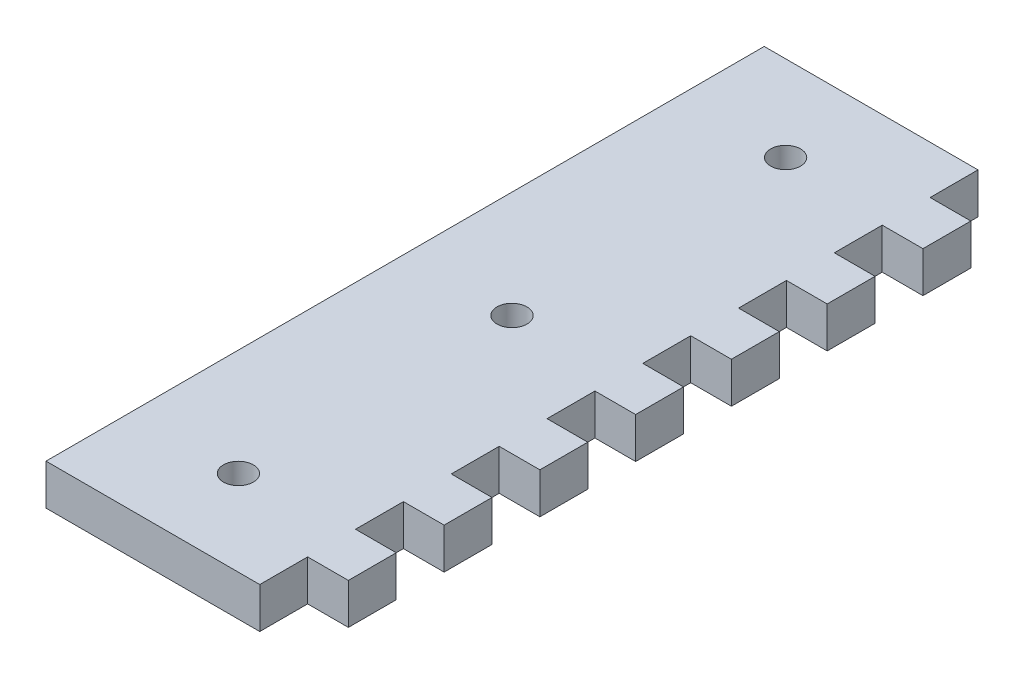
ISO-10303-21;
HEADER;
FILE_DESCRIPTION(('STEP AP214'),'2;1');
FILE_NAME('part.step','',(''),(''),'','','');
FILE_SCHEMA(('AUTOMOTIVE_DESIGN { 1 0 10303 214 1 1 1 1 }'));
ENDSEC;
DATA;
#1=APPLICATION_CONTEXT('core data for automotive mechanical design processes');
#2=APPLICATION_PROTOCOL_DEFINITION('international standard','automotive_design',2000,#1);
#3=PRODUCT_CONTEXT('',#1,'mechanical');
#4=PRODUCT('Part','Part','',(#3));
#5=PRODUCT_RELATED_PRODUCT_CATEGORY('part','',(#4));
#6=PRODUCT_DEFINITION_FORMATION('','',#4);
#7=PRODUCT_DEFINITION_CONTEXT('part definition',#1,'design');
#8=PRODUCT_DEFINITION('design','',#6,#7);
#9=PRODUCT_DEFINITION_SHAPE('','',#8);
#10=(LENGTH_UNIT() NAMED_UNIT(*) SI_UNIT(.MILLI.,.METRE.));
#11=(NAMED_UNIT(*) PLANE_ANGLE_UNIT() SI_UNIT($,.RADIAN.));
#12=(NAMED_UNIT(*) SI_UNIT($,.STERADIAN.) SOLID_ANGLE_UNIT());
#13=UNCERTAINTY_MEASURE_WITH_UNIT(LENGTH_MEASURE(1.E-05),#10,'distance_accuracy_value','');
#14=(GEOMETRIC_REPRESENTATION_CONTEXT(3) GLOBAL_UNCERTAINTY_ASSIGNED_CONTEXT((#13)) GLOBAL_UNIT_ASSIGNED_CONTEXT((#10,
#11,#12)) REPRESENTATION_CONTEXT('',''));
#15=CARTESIAN_POINT('',(0.,0.,0.));
#16=DIRECTION('',(0.,0.,1.));
#17=DIRECTION('',(1.,0.,0.));
#18=AXIS2_PLACEMENT_3D('',#15,#16,#17);
#19=CARTESIAN_POINT('',(0.,4.7625,0.));
#20=DIRECTION('',(0.,0.,-1.));
#21=DIRECTION('',(-1.,0.,0.));
#22=AXIS2_PLACEMENT_3D('',#19,#20,#21);
#23=PLANE('',#22);
#24=DIRECTION('',(1.,0.,0.));
#25=VECTOR('',#24,1.);
#26=CARTESIAN_POINT('',(0.,0.,0.));
#27=LINE('',#26,#25);
#28=CARTESIAN_POINT('',(0.,0.,0.));
#29=VERTEX_POINT('',#28);
#30=CARTESIAN_POINT('',(25.,0.,0.));
#31=VERTEX_POINT('',#30);
#32=EDGE_CURVE('E302',#29,#31,#27,.T.);
#33=ORIENTED_EDGE('',*,*,#32,.T.);
#34=DIRECTION('',(0.,-1.,0.));
#35=VECTOR('',#34,1.);
#36=CARTESIAN_POINT('',(25.,4.7625,0.));
#37=LINE('',#36,#35);
#38=CARTESIAN_POINT('',(25.,4.7625,0.));
#39=VERTEX_POINT('',#38);
#40=EDGE_CURVE('E11',#39,#31,#37,.T.);
#41=ORIENTED_EDGE('',*,*,#40,.F.);
#42=DIRECTION('',(1.,0.,0.));
#43=VECTOR('',#42,1.);
#44=CARTESIAN_POINT('',(0.,4.7625,0.));
#45=LINE('',#44,#43);
#46=CARTESIAN_POINT('',(0.,4.7625,0.));
#47=VERTEX_POINT('',#46);
#48=EDGE_CURVE('E1057',#47,#39,#45,.T.);
#49=ORIENTED_EDGE('',*,*,#48,.F.);
#50=DIRECTION('',(0.,-1.,0.));
#51=VECTOR('',#50,1.);
#52=CARTESIAN_POINT('',(0.,4.7625,0.));
#53=LINE('',#52,#51);
#54=EDGE_CURVE('E59',#47,#29,#53,.T.);
#55=ORIENTED_EDGE('',*,*,#54,.T.);
#56=EDGE_LOOP('',(#33,#41,#49,#55));
#57=FACE_BOUND('',#56,.T.);
#58=ADVANCED_FACE('F41',(#57),#23,.F.);
#59=CARTESIAN_POINT('',(25.,4.7625,0.));
#60=DIRECTION('',(-1.,0.,0.));
#61=DIRECTION('',(0.,0.,1.));
#62=AXIS2_PLACEMENT_3D('',#59,#60,#61);
#63=PLANE('',#62);
#64=DIRECTION('',(0.,0.,-1.));
#65=VECTOR('',#64,1.);
#66=CARTESIAN_POINT('',(25.,0.,0.));
#67=LINE('',#66,#65);
#68=CARTESIAN_POINT('',(25.,0.,-5.60000000000009));
#69=VERTEX_POINT('',#68);
#70=EDGE_CURVE('E305',#31,#69,#67,.T.);
#71=ORIENTED_EDGE('',*,*,#70,.T.);
#72=DIRECTION('',(0.,-1.,0.));
#73=VECTOR('',#72,1.);
#74=CARTESIAN_POINT('',(25.,4.7625,-5.60000000000009));
#75=LINE('',#74,#73);
#76=CARTESIAN_POINT('',(25.,4.7625,-5.60000000000009));
#77=VERTEX_POINT('',#76);
#78=EDGE_CURVE('E51',#77,#69,#75,.T.);
#79=ORIENTED_EDGE('',*,*,#78,.F.);
#80=DIRECTION('',(0.,0.,-1.));
#81=VECTOR('',#80,1.);
#82=CARTESIAN_POINT('',(25.,4.7625,0.));
#83=LINE('',#82,#81);
#84=EDGE_CURVE('E169',#39,#77,#83,.T.);
#85=ORIENTED_EDGE('',*,*,#84,.F.);
#86=ORIENTED_EDGE('',*,*,#40,.T.);
#87=EDGE_LOOP('',(#71,#79,#85,#86));
#88=FACE_BOUND('',#87,.T.);
#89=ADVANCED_FACE('F704',(#88),#63,.F.);
#90=CARTESIAN_POINT('',(0.,4.7625,-5.59999999999999));
#91=DIRECTION('',(0.,0.,-1.));
#92=DIRECTION('',(-1.,0.,0.));
#93=AXIS2_PLACEMENT_3D('',#90,#91,#92);
#94=PLANE('',#93);
#95=DIRECTION('',(1.,0.,0.));
#96=VECTOR('',#95,1.);
#97=CARTESIAN_POINT('',(0.,0.,-5.59999999999999));
#98=LINE('',#97,#96);
#99=CARTESIAN_POINT('',(29.7624999999998,0.,-5.6000000000001));
#100=VERTEX_POINT('',#99);
#101=EDGE_CURVE('E308',#69,#100,#98,.T.);
#102=ORIENTED_EDGE('',*,*,#101,.T.);
#103=DIRECTION('',(0.,-1.,0.));
#104=VECTOR('',#103,1.);
#105=CARTESIAN_POINT('',(29.7624999999998,4.7625,-5.6000000000001));
#106=LINE('',#105,#104);
#107=CARTESIAN_POINT('',(29.7624999999998,4.7625,-5.6000000000001));
#108=VERTEX_POINT('',#107);
#109=EDGE_CURVE('E491',#108,#100,#106,.T.);
#110=ORIENTED_EDGE('',*,*,#109,.F.);
#111=DIRECTION('',(1.,0.,0.));
#112=VECTOR('',#111,1.);
#113=CARTESIAN_POINT('',(0.,4.7625,-5.59999999999999));
#114=LINE('',#113,#112);
#115=EDGE_CURVE('E501',#77,#108,#114,.T.);
#116=ORIENTED_EDGE('',*,*,#115,.F.);
#117=ORIENTED_EDGE('',*,*,#78,.T.);
#118=EDGE_LOOP('',(#102,#110,#116,#117));
#119=FACE_BOUND('',#118,.T.);
#120=ADVANCED_FACE('F499',(#119),#94,.F.);
#121=CARTESIAN_POINT('',(29.7624999999999,4.7625,-1.10635087400913E-13));
#122=DIRECTION('',(-1.,0.,0.));
#123=DIRECTION('',(0.,0.,1.));
#124=AXIS2_PLACEMENT_3D('',#121,#122,#123);
#125=PLANE('',#124);
#126=DIRECTION('',(0.,0.,-1.));
#127=VECTOR('',#126,1.);
#128=CARTESIAN_POINT('',(29.7624999999999,0.,-1.10635087400913E-13));
#129=LINE('',#128,#127);
#130=CARTESIAN_POINT('',(29.7624999999998,0.,-11.2000000000001));
#131=VERTEX_POINT('',#130);
#132=EDGE_CURVE('E312',#100,#131,#129,.T.);
#133=ORIENTED_EDGE('',*,*,#132,.T.);
#134=DIRECTION('',(0.,-1.,0.));
#135=VECTOR('',#134,1.);
#136=CARTESIAN_POINT('',(29.7624999999998,4.7625,-11.2000000000001));
#137=LINE('',#136,#135);
#138=CARTESIAN_POINT('',(29.7624999999998,4.7625,-11.2000000000001));
#139=VERTEX_POINT('',#138);
#140=EDGE_CURVE('E487',#139,#131,#137,.T.);
#141=ORIENTED_EDGE('',*,*,#140,.F.);
#142=DIRECTION('',(0.,0.,-1.));
#143=VECTOR('',#142,1.);
#144=CARTESIAN_POINT('',(29.7624999999999,4.7625,-1.10635087400913E-13));
#145=LINE('',#144,#143);
#146=EDGE_CURVE('E519',#108,#139,#145,.T.);
#147=ORIENTED_EDGE('',*,*,#146,.F.);
#148=ORIENTED_EDGE('',*,*,#109,.T.);
#149=EDGE_LOOP('',(#133,#141,#147,#148));
#150=FACE_BOUND('',#149,.T.);
#151=ADVANCED_FACE('F509',(#150),#125,.F.);
#152=CARTESIAN_POINT('',(0.,4.7625,-11.2));
#153=DIRECTION('',(0.,0.,1.));
#154=DIRECTION('',(1.,0.,0.));
#155=AXIS2_PLACEMENT_3D('',#152,#153,#154);
#156=PLANE('',#155);
#157=DIRECTION('',(-1.,0.,0.));
#158=VECTOR('',#157,1.);
#159=CARTESIAN_POINT('',(0.,0.,-11.2));
#160=LINE('',#159,#158);
#161=CARTESIAN_POINT('',(25.,0.,-11.2000000000001));
#162=VERTEX_POINT('',#161);
#163=EDGE_CURVE('E315',#131,#162,#160,.T.);
#164=ORIENTED_EDGE('',*,*,#163,.T.);
#165=DIRECTION('',(0.,-1.,0.));
#166=VECTOR('',#165,1.);
#167=CARTESIAN_POINT('',(25.,4.7625,-11.2000000000001));
#168=LINE('',#167,#166);
#169=CARTESIAN_POINT('',(25.,4.7625,-11.2000000000001));
#170=VERTEX_POINT('',#169);
#171=EDGE_CURVE('E483',#170,#162,#168,.T.);
#172=ORIENTED_EDGE('',*,*,#171,.F.);
#173=DIRECTION('',(-1.,0.,0.));
#174=VECTOR('',#173,1.);
#175=CARTESIAN_POINT('',(0.,4.7625,-11.2));
#176=LINE('',#175,#174);
#177=EDGE_CURVE('E515',#139,#170,#176,.T.);
#178=ORIENTED_EDGE('',*,*,#177,.F.);
#179=ORIENTED_EDGE('',*,*,#140,.T.);
#180=EDGE_LOOP('',(#164,#172,#178,#179));
#181=FACE_BOUND('',#180,.T.);
#182=ADVANCED_FACE('F513',(#181),#156,.F.);
#183=CARTESIAN_POINT('',(24.9999999999999,0.,-16.8000000000001));
#184=VERTEX_POINT('',#183);
#185=EDGE_CURVE('E309',#162,#184,#67,.T.);
#186=ORIENTED_EDGE('',*,*,#185,.T.);
#187=DIRECTION('',(0.,-1.,0.));
#188=VECTOR('',#187,1.);
#189=CARTESIAN_POINT('',(24.9999999999999,4.7625,-16.8000000000001));
#190=LINE('',#189,#188);
#191=CARTESIAN_POINT('',(24.9999999999999,4.7625,-16.8000000000001));
#192=VERTEX_POINT('',#191);
#193=EDGE_CURVE('E479',#192,#184,#190,.T.);
#194=ORIENTED_EDGE('',*,*,#193,.F.);
#195=EDGE_CURVE('E518',#170,#192,#83,.T.);
#196=ORIENTED_EDGE('',*,*,#195,.F.);
#197=ORIENTED_EDGE('',*,*,#171,.T.);
#198=EDGE_LOOP('',(#186,#194,#196,#197));
#199=FACE_BOUND('',#198,.T.);
#200=ADVANCED_FACE('F614',(#199),#63,.F.);
#201=CARTESIAN_POINT('',(0.,4.7625,-16.8));
#202=DIRECTION('',(0.,0.,-1.));
#203=DIRECTION('',(-1.,0.,0.));
#204=AXIS2_PLACEMENT_3D('',#201,#202,#203);
#205=PLANE('',#204);
#206=DIRECTION('',(1.,0.,0.));
#207=VECTOR('',#206,1.);
#208=CARTESIAN_POINT('',(0.,0.,-16.8));
#209=LINE('',#208,#207);
#210=CARTESIAN_POINT('',(29.7624999999998,0.,-16.8000000000001));
#211=VERTEX_POINT('',#210);
#212=EDGE_CURVE('E318',#184,#211,#209,.T.);
#213=ORIENTED_EDGE('',*,*,#212,.T.);
#214=DIRECTION('',(0.,-1.,0.));
#215=VECTOR('',#214,1.);
#216=CARTESIAN_POINT('',(29.7624999999998,4.7625,-16.8000000000001));
#217=LINE('',#216,#215);
#218=CARTESIAN_POINT('',(29.7624999999998,4.7625,-16.8000000000001));
#219=VERTEX_POINT('',#218);
#220=EDGE_CURVE('E475',#219,#211,#217,.T.);
#221=ORIENTED_EDGE('',*,*,#220,.F.);
#222=DIRECTION('',(1.,0.,0.));
#223=VECTOR('',#222,1.);
#224=CARTESIAN_POINT('',(0.,4.7625,-16.8));
#225=LINE('',#224,#223);
#226=EDGE_CURVE('E523',#192,#219,#225,.T.);
#227=ORIENTED_EDGE('',*,*,#226,.F.);
#228=ORIENTED_EDGE('',*,*,#193,.T.);
#229=EDGE_LOOP('',(#213,#221,#227,#228));
#230=FACE_BOUND('',#229,.T.);
#231=ADVANCED_FACE('F618',(#230),#205,.F.);
#232=CARTESIAN_POINT('',(29.7624999999999,4.7625,-1.10635087400913E-13));
#233=DIRECTION('',(-1.,0.,0.));
#234=DIRECTION('',(0.,0.,1.));
#235=AXIS2_PLACEMENT_3D('',#232,#233,#234);
#236=PLANE('',#235);
#237=DIRECTION('',(0.,0.,-1.));
#238=VECTOR('',#237,1.);
#239=CARTESIAN_POINT('',(29.7624999999999,0.,-1.10635087400913E-13));
#240=LINE('',#239,#238);
#241=CARTESIAN_POINT('',(29.7624999999998,0.,-22.4000000000001));
#242=VERTEX_POINT('',#241);
#243=EDGE_CURVE('E321',#211,#242,#240,.T.);
#244=ORIENTED_EDGE('',*,*,#243,.T.);
#245=DIRECTION('',(0.,-1.,0.));
#246=VECTOR('',#245,1.);
#247=CARTESIAN_POINT('',(29.7624999999998,4.7625,-22.4000000000001));
#248=LINE('',#247,#246);
#249=CARTESIAN_POINT('',(29.7624999999998,4.7625,-22.4000000000001));
#250=VERTEX_POINT('',#249);
#251=EDGE_CURVE('E471',#250,#242,#248,.T.);
#252=ORIENTED_EDGE('',*,*,#251,.F.);
#253=DIRECTION('',(0.,0.,-1.));
#254=VECTOR('',#253,1.);
#255=CARTESIAN_POINT('',(29.7624999999999,4.7625,-1.10635087400913E-13));
#256=LINE('',#255,#254);
#257=EDGE_CURVE('E530',#219,#250,#256,.T.);
#258=ORIENTED_EDGE('',*,*,#257,.F.);
#259=ORIENTED_EDGE('',*,*,#220,.T.);
#260=EDGE_LOOP('',(#244,#252,#258,#259));
#261=FACE_BOUND('',#260,.T.);
#262=ADVANCED_FACE('F624',(#261),#236,.F.);
#263=CARTESIAN_POINT('',(0.,4.7625,-22.4));
#264=DIRECTION('',(0.,0.,1.));
#265=DIRECTION('',(1.,0.,0.));
#266=AXIS2_PLACEMENT_3D('',#263,#264,#265);
#267=PLANE('',#266);
#268=DIRECTION('',(-1.,0.,0.));
#269=VECTOR('',#268,1.);
#270=CARTESIAN_POINT('',(0.,0.,-22.4));
#271=LINE('',#270,#269);
#272=CARTESIAN_POINT('',(24.9999999999999,0.,-22.4000000000001));
#273=VERTEX_POINT('',#272);
#274=EDGE_CURVE('E324',#242,#273,#271,.T.);
#275=ORIENTED_EDGE('',*,*,#274,.T.);
#276=DIRECTION('',(0.,-1.,0.));
#277=VECTOR('',#276,1.);
#278=CARTESIAN_POINT('',(24.9999999999999,4.7625,-22.4000000000001));
#279=LINE('',#278,#277);
#280=CARTESIAN_POINT('',(24.9999999999999,4.7625,-22.4000000000001));
#281=VERTEX_POINT('',#280);
#282=EDGE_CURVE('E467',#281,#273,#279,.T.);
#283=ORIENTED_EDGE('',*,*,#282,.F.);
#284=DIRECTION('',(-1.,0.,0.));
#285=VECTOR('',#284,1.);
#286=CARTESIAN_POINT('',(0.,4.7625,-22.4));
#287=LINE('',#286,#285);
#288=EDGE_CURVE('E533',#250,#281,#287,.T.);
#289=ORIENTED_EDGE('',*,*,#288,.F.);
#290=ORIENTED_EDGE('',*,*,#251,.T.);
#291=EDGE_LOOP('',(#275,#283,#289,#290));
#292=FACE_BOUND('',#291,.T.);
#293=ADVANCED_FACE('F628',(#292),#267,.F.);
#294=CARTESIAN_POINT('',(24.9999999999999,0.,-28.0000000000001));
#295=VERTEX_POINT('',#294);
#296=EDGE_CURVE('E327',#273,#295,#67,.T.);
#297=ORIENTED_EDGE('',*,*,#296,.T.);
#298=DIRECTION('',(0.,-1.,0.));
#299=VECTOR('',#298,1.);
#300=CARTESIAN_POINT('',(24.9999999999999,4.7625,-28.0000000000001));
#301=LINE('',#300,#299);
#302=CARTESIAN_POINT('',(24.9999999999999,4.7625,-28.0000000000001));
#303=VERTEX_POINT('',#302);
#304=EDGE_CURVE('E463',#303,#295,#301,.T.);
#305=ORIENTED_EDGE('',*,*,#304,.F.);
#306=EDGE_CURVE('E524',#281,#303,#83,.T.);
#307=ORIENTED_EDGE('',*,*,#306,.F.);
#308=ORIENTED_EDGE('',*,*,#282,.T.);
#309=EDGE_LOOP('',(#297,#305,#307,#308));
#310=FACE_BOUND('',#309,.T.);
#311=ADVANCED_FACE('F634',(#310),#63,.F.);
#312=CARTESIAN_POINT('',(0.,4.7625,-28.));
#313=DIRECTION('',(0.,0.,-1.));
#314=DIRECTION('',(-1.,0.,0.));
#315=AXIS2_PLACEMENT_3D('',#312,#313,#314);
#316=PLANE('',#315);
#317=DIRECTION('',(1.,0.,0.));
#318=VECTOR('',#317,1.);
#319=CARTESIAN_POINT('',(0.,0.,-28.));
#320=LINE('',#319,#318);
#321=CARTESIAN_POINT('',(29.7624999999998,0.,-28.0000000000001));
#322=VERTEX_POINT('',#321);
#323=EDGE_CURVE('E328',#295,#322,#320,.T.);
#324=ORIENTED_EDGE('',*,*,#323,.T.);
#325=DIRECTION('',(0.,-1.,0.));
#326=VECTOR('',#325,1.);
#327=CARTESIAN_POINT('',(29.7624999999998,4.7625,-28.0000000000001));
#328=LINE('',#327,#326);
#329=CARTESIAN_POINT('',(29.7624999999998,4.7625,-28.0000000000001));
#330=VERTEX_POINT('',#329);
#331=EDGE_CURVE('E459',#330,#322,#328,.T.);
#332=ORIENTED_EDGE('',*,*,#331,.F.);
#333=DIRECTION('',(1.,0.,0.));
#334=VECTOR('',#333,1.);
#335=CARTESIAN_POINT('',(0.,4.7625,-28.));
#336=LINE('',#335,#334);
#337=EDGE_CURVE('E536',#303,#330,#336,.T.);
#338=ORIENTED_EDGE('',*,*,#337,.F.);
#339=ORIENTED_EDGE('',*,*,#304,.T.);
#340=EDGE_LOOP('',(#324,#332,#338,#339));
#341=FACE_BOUND('',#340,.T.);
#342=ADVANCED_FACE('F637',(#341),#316,.F.);
#343=CARTESIAN_POINT('',(29.7624999999999,4.7625,-1.10635087400913E-13));
#344=DIRECTION('',(-1.,0.,0.));
#345=DIRECTION('',(0.,0.,1.));
#346=AXIS2_PLACEMENT_3D('',#343,#344,#345);
#347=PLANE('',#346);
#348=DIRECTION('',(0.,0.,-1.));
#349=VECTOR('',#348,1.);
#350=CARTESIAN_POINT('',(29.7624999999999,0.,-1.10635087400913E-13));
#351=LINE('',#350,#349);
#352=CARTESIAN_POINT('',(29.7624999999997,0.,-33.6000000000001));
#353=VERTEX_POINT('',#352);
#354=EDGE_CURVE('E331',#322,#353,#351,.T.);
#355=ORIENTED_EDGE('',*,*,#354,.T.);
#356=DIRECTION('',(0.,-1.,0.));
#357=VECTOR('',#356,1.);
#358=CARTESIAN_POINT('',(29.7624999999997,4.7625,-33.6000000000001));
#359=LINE('',#358,#357);
#360=CARTESIAN_POINT('',(29.7624999999997,4.7625,-33.6000000000001));
#361=VERTEX_POINT('',#360);
#362=EDGE_CURVE('E455',#361,#353,#359,.T.);
#363=ORIENTED_EDGE('',*,*,#362,.F.);
#364=DIRECTION('',(0.,0.,-1.));
#365=VECTOR('',#364,1.);
#366=CARTESIAN_POINT('',(29.7624999999999,4.7625,-1.10635087400913E-13));
#367=LINE('',#366,#365);
#368=EDGE_CURVE('E539',#330,#361,#367,.T.);
#369=ORIENTED_EDGE('',*,*,#368,.F.);
#370=ORIENTED_EDGE('',*,*,#331,.T.);
#371=EDGE_LOOP('',(#355,#363,#369,#370));
#372=FACE_BOUND('',#371,.T.);
#373=ADVANCED_FACE('F642',(#372),#347,.F.);
#374=CARTESIAN_POINT('',(0.,4.7625,-33.6));
#375=DIRECTION('',(0.,0.,1.));
#376=DIRECTION('',(1.,0.,0.));
#377=AXIS2_PLACEMENT_3D('',#374,#375,#376);
#378=PLANE('',#377);
#379=DIRECTION('',(-1.,0.,0.));
#380=VECTOR('',#379,1.);
#381=CARTESIAN_POINT('',(0.,0.,-33.6));
#382=LINE('',#381,#380);
#383=CARTESIAN_POINT('',(24.9999999999999,0.,-33.6000000000001));
#384=VERTEX_POINT('',#383);
#385=EDGE_CURVE('E334',#353,#384,#382,.T.);
#386=ORIENTED_EDGE('',*,*,#385,.T.);
#387=DIRECTION('',(0.,-1.,0.));
#388=VECTOR('',#387,1.);
#389=CARTESIAN_POINT('',(24.9999999999999,4.7625,-33.6000000000001));
#390=LINE('',#389,#388);
#391=CARTESIAN_POINT('',(24.9999999999999,4.7625,-33.6000000000001));
#392=VERTEX_POINT('',#391);
#393=EDGE_CURVE('E451',#392,#384,#390,.T.);
#394=ORIENTED_EDGE('',*,*,#393,.F.);
#395=DIRECTION('',(-1.,0.,0.));
#396=VECTOR('',#395,1.);
#397=CARTESIAN_POINT('',(0.,4.7625,-33.6));
#398=LINE('',#397,#396);
#399=EDGE_CURVE('E542',#361,#392,#398,.T.);
#400=ORIENTED_EDGE('',*,*,#399,.F.);
#401=ORIENTED_EDGE('',*,*,#362,.T.);
#402=EDGE_LOOP('',(#386,#394,#400,#401));
#403=FACE_BOUND('',#402,.T.);
#404=ADVANCED_FACE('F647',(#403),#378,.F.);
#405=CARTESIAN_POINT('',(24.9999999999999,0.,-39.2000000000001));
#406=VERTEX_POINT('',#405);
#407=EDGE_CURVE('E337',#384,#406,#67,.T.);
#408=ORIENTED_EDGE('',*,*,#407,.T.);
#409=DIRECTION('',(0.,-1.,0.));
#410=VECTOR('',#409,1.);
#411=CARTESIAN_POINT('',(24.9999999999999,4.7625,-39.2000000000001));
#412=LINE('',#411,#410);
#413=CARTESIAN_POINT('',(24.9999999999999,4.7625,-39.2000000000001));
#414=VERTEX_POINT('',#413);
#415=EDGE_CURVE('E447',#414,#406,#412,.T.);
#416=ORIENTED_EDGE('',*,*,#415,.F.);
#417=EDGE_CURVE('E545',#392,#414,#83,.T.);
#418=ORIENTED_EDGE('',*,*,#417,.F.);
#419=ORIENTED_EDGE('',*,*,#393,.T.);
#420=EDGE_LOOP('',(#408,#416,#418,#419));
#421=FACE_BOUND('',#420,.T.);
#422=ADVANCED_FACE('F649',(#421),#63,.F.);
#423=CARTESIAN_POINT('',(-1.71341506162623E-13,4.7625,-39.2));
#424=DIRECTION('',(0.,0.,-1.));
#425=DIRECTION('',(-1.,0.,0.));
#426=AXIS2_PLACEMENT_3D('',#423,#424,#425);
#427=PLANE('',#426);
#428=DIRECTION('',(1.,0.,0.));
#429=VECTOR('',#428,1.);
#430=CARTESIAN_POINT('',(-1.71341506162623E-13,0.,-39.2));
#431=LINE('',#430,#429);
#432=CARTESIAN_POINT('',(29.7624999999997,0.,-39.2000000000001));
#433=VERTEX_POINT('',#432);
#434=EDGE_CURVE('E338',#406,#433,#431,.T.);
#435=ORIENTED_EDGE('',*,*,#434,.T.);
#436=DIRECTION('',(0.,-1.,0.));
#437=VECTOR('',#436,1.);
#438=CARTESIAN_POINT('',(29.7624999999997,4.7625,-39.2000000000001));
#439=LINE('',#438,#437);
#440=CARTESIAN_POINT('',(29.7624999999997,4.7625,-39.2000000000001));
#441=VERTEX_POINT('',#440);
#442=EDGE_CURVE('E443',#441,#433,#439,.T.);
#443=ORIENTED_EDGE('',*,*,#442,.F.);
#444=DIRECTION('',(1.,0.,0.));
#445=VECTOR('',#444,1.);
#446=CARTESIAN_POINT('',(-1.71341506162623E-13,4.7625,-39.2));
#447=LINE('',#446,#445);
#448=EDGE_CURVE('E546',#414,#441,#447,.T.);
#449=ORIENTED_EDGE('',*,*,#448,.F.);
#450=ORIENTED_EDGE('',*,*,#415,.T.);
#451=EDGE_LOOP('',(#435,#443,#449,#450));
#452=FACE_BOUND('',#451,.T.);
#453=ADVANCED_FACE('F772',(#452),#427,.F.);
#454=CARTESIAN_POINT('',(29.7624999999999,4.7625,-1.10635087400913E-13));
#455=DIRECTION('',(-1.,0.,0.));
#456=DIRECTION('',(0.,0.,1.));
#457=AXIS2_PLACEMENT_3D('',#454,#455,#456);
#458=PLANE('',#457);
#459=DIRECTION('',(0.,0.,-1.));
#460=VECTOR('',#459,1.);
#461=CARTESIAN_POINT('',(29.7624999999999,0.,-1.10635087400913E-13));
#462=LINE('',#461,#460);
#463=CARTESIAN_POINT('',(29.7624999999997,0.,-44.8000000000001));
#464=VERTEX_POINT('',#463);
#465=EDGE_CURVE('E341',#433,#464,#462,.T.);
#466=ORIENTED_EDGE('',*,*,#465,.T.);
#467=DIRECTION('',(0.,-1.,0.));
#468=VECTOR('',#467,1.);
#469=CARTESIAN_POINT('',(29.7624999999997,4.7625,-44.8000000000001));
#470=LINE('',#469,#468);
#471=CARTESIAN_POINT('',(29.7624999999997,4.7625,-44.8000000000001));
#472=VERTEX_POINT('',#471);
#473=EDGE_CURVE('E439',#472,#464,#470,.T.);
#474=ORIENTED_EDGE('',*,*,#473,.F.);
#475=DIRECTION('',(0.,0.,-1.));
#476=VECTOR('',#475,1.);
#477=CARTESIAN_POINT('',(29.7624999999999,4.7625,-1.10635087400913E-13));
#478=LINE('',#477,#476);
#479=EDGE_CURVE('E549',#441,#472,#478,.T.);
#480=ORIENTED_EDGE('',*,*,#479,.F.);
#481=ORIENTED_EDGE('',*,*,#442,.T.);
#482=EDGE_LOOP('',(#466,#474,#480,#481));
#483=FACE_BOUND('',#482,.T.);
#484=ADVANCED_FACE('F768',(#483),#458,.F.);
#485=CARTESIAN_POINT('',(-1.95818864185854E-13,4.7625,-44.8));
#486=DIRECTION('',(0.,0.,1.));
#487=DIRECTION('',(1.,0.,0.));
#488=AXIS2_PLACEMENT_3D('',#485,#486,#487);
#489=PLANE('',#488);
#490=DIRECTION('',(-1.,0.,0.));
#491=VECTOR('',#490,1.);
#492=CARTESIAN_POINT('',(-1.95818864185854E-13,0.,-44.8));
#493=LINE('',#492,#491);
#494=CARTESIAN_POINT('',(24.9999999999998,0.,-44.8000000000001));
#495=VERTEX_POINT('',#494);
#496=EDGE_CURVE('E344',#464,#495,#493,.T.);
#497=ORIENTED_EDGE('',*,*,#496,.T.);
#498=DIRECTION('',(0.,-1.,0.));
#499=VECTOR('',#498,1.);
#500=CARTESIAN_POINT('',(24.9999999999998,4.7625,-44.8000000000001));
#501=LINE('',#500,#499);
#502=CARTESIAN_POINT('',(24.9999999999998,4.7625,-44.8000000000001));
#503=VERTEX_POINT('',#502);
#504=EDGE_CURVE('E435',#503,#495,#501,.T.);
#505=ORIENTED_EDGE('',*,*,#504,.F.);
#506=DIRECTION('',(-1.,0.,0.));
#507=VECTOR('',#506,1.);
#508=CARTESIAN_POINT('',(-1.95818864185854E-13,4.7625,-44.8));
#509=LINE('',#508,#507);
#510=EDGE_CURVE('E552',#472,#503,#509,.T.);
#511=ORIENTED_EDGE('',*,*,#510,.F.);
#512=ORIENTED_EDGE('',*,*,#473,.T.);
#513=EDGE_LOOP('',(#497,#505,#511,#512));
#514=FACE_BOUND('',#513,.T.);
#515=ADVANCED_FACE('F702',(#514),#489,.F.);
#516=CARTESIAN_POINT('',(24.9999999999998,0.,-50.4000000000001));
#517=VERTEX_POINT('',#516);
#518=EDGE_CURVE('E347',#495,#517,#67,.T.);
#519=ORIENTED_EDGE('',*,*,#518,.T.);
#520=DIRECTION('',(0.,-1.,0.));
#521=VECTOR('',#520,1.);
#522=CARTESIAN_POINT('',(24.9999999999998,4.7625,-50.4000000000001));
#523=LINE('',#522,#521);
#524=CARTESIAN_POINT('',(24.9999999999998,4.7625,-50.4000000000001));
#525=VERTEX_POINT('',#524);
#526=EDGE_CURVE('E431',#525,#517,#523,.T.);
#527=ORIENTED_EDGE('',*,*,#526,.F.);
#528=EDGE_CURVE('E555',#503,#525,#83,.T.);
#529=ORIENTED_EDGE('',*,*,#528,.F.);
#530=ORIENTED_EDGE('',*,*,#504,.T.);
#531=EDGE_LOOP('',(#519,#527,#529,#530));
#532=FACE_BOUND('',#531,.T.);
#533=ADVANCED_FACE('F689',(#532),#63,.F.);
#534=CARTESIAN_POINT('',(-2.20296222209086E-13,4.7625,-50.4));
#535=DIRECTION('',(0.,0.,-1.));
#536=DIRECTION('',(-1.,0.,0.));
#537=AXIS2_PLACEMENT_3D('',#534,#535,#536);
#538=PLANE('',#537);
#539=DIRECTION('',(1.,0.,0.));
#540=VECTOR('',#539,1.);
#541=CARTESIAN_POINT('',(-2.20296222209086E-13,0.,-50.4));
#542=LINE('',#541,#540);
#543=CARTESIAN_POINT('',(29.7624999999997,0.,-50.4000000000001));
#544=VERTEX_POINT('',#543);
#545=EDGE_CURVE('E348',#517,#544,#542,.T.);
#546=ORIENTED_EDGE('',*,*,#545,.T.);
#547=DIRECTION('',(0.,-1.,0.));
#548=VECTOR('',#547,1.);
#549=CARTESIAN_POINT('',(29.7624999999997,4.7625,-50.4000000000001));
#550=LINE('',#549,#548);
#551=CARTESIAN_POINT('',(29.7624999999997,4.7625,-50.4000000000001));
#552=VERTEX_POINT('',#551);
#553=EDGE_CURVE('E427',#552,#544,#550,.T.);
#554=ORIENTED_EDGE('',*,*,#553,.F.);
#555=DIRECTION('',(1.,0.,0.));
#556=VECTOR('',#555,1.);
#557=CARTESIAN_POINT('',(-2.20296222209086E-13,4.7625,-50.4));
#558=LINE('',#557,#556);
#559=EDGE_CURVE('E556',#525,#552,#558,.T.);
#560=ORIENTED_EDGE('',*,*,#559,.F.);
#561=ORIENTED_EDGE('',*,*,#526,.T.);
#562=EDGE_LOOP('',(#546,#554,#560,#561));
#563=FACE_BOUND('',#562,.T.);
#564=ADVANCED_FACE('F701',(#563),#538,.F.);
#565=CARTESIAN_POINT('',(29.7624999999999,4.7625,-1.10635087400913E-13));
#566=DIRECTION('',(-1.,0.,0.));
#567=DIRECTION('',(0.,0.,1.));
#568=AXIS2_PLACEMENT_3D('',#565,#566,#567);
#569=PLANE('',#568);
#570=DIRECTION('',(0.,0.,-1.));
#571=VECTOR('',#570,1.);
#572=CARTESIAN_POINT('',(29.7624999999999,0.,-1.10635087400913E-13));
#573=LINE('',#572,#571);
#574=CARTESIAN_POINT('',(29.7624999999997,0.,-56.0000000000001));
#575=VERTEX_POINT('',#574);
#576=EDGE_CURVE('E351',#544,#575,#573,.T.);
#577=ORIENTED_EDGE('',*,*,#576,.T.);
#578=DIRECTION('',(0.,-1.,0.));
#579=VECTOR('',#578,1.);
#580=CARTESIAN_POINT('',(29.7624999999997,4.7625,-56.0000000000001));
#581=LINE('',#580,#579);
#582=CARTESIAN_POINT('',(29.7624999999997,4.7625,-56.0000000000001));
#583=VERTEX_POINT('',#582);
#584=EDGE_CURVE('E423',#583,#575,#581,.T.);
#585=ORIENTED_EDGE('',*,*,#584,.F.);
#586=DIRECTION('',(0.,0.,-1.));
#587=VECTOR('',#586,1.);
#588=CARTESIAN_POINT('',(29.7624999999999,4.7625,-1.10635087400913E-13));
#589=LINE('',#588,#587);
#590=EDGE_CURVE('E559',#552,#583,#589,.T.);
#591=ORIENTED_EDGE('',*,*,#590,.F.);
#592=ORIENTED_EDGE('',*,*,#553,.T.);
#593=EDGE_LOOP('',(#577,#585,#591,#592));
#594=FACE_BOUND('',#593,.T.);
#595=ADVANCED_FACE('F695',(#594),#569,.F.);
#596=CARTESIAN_POINT('',(-2.44773580232318E-13,4.7625,-56.));
#597=DIRECTION('',(0.,0.,1.));
#598=DIRECTION('',(1.,0.,0.));
#599=AXIS2_PLACEMENT_3D('',#596,#597,#598);
#600=PLANE('',#599);
#601=DIRECTION('',(-1.,0.,0.));
#602=VECTOR('',#601,1.);
#603=CARTESIAN_POINT('',(-2.44773580232318E-13,0.,-56.));
#604=LINE('',#603,#602);
#605=CARTESIAN_POINT('',(24.9999999999998,0.,-56.0000000000001));
#606=VERTEX_POINT('',#605);
#607=EDGE_CURVE('E354',#575,#606,#604,.T.);
#608=ORIENTED_EDGE('',*,*,#607,.T.);
#609=DIRECTION('',(0.,-1.,0.));
#610=VECTOR('',#609,1.);
#611=CARTESIAN_POINT('',(24.9999999999998,4.7625,-56.0000000000001));
#612=LINE('',#611,#610);
#613=CARTESIAN_POINT('',(24.9999999999998,4.7625,-56.0000000000001));
#614=VERTEX_POINT('',#613);
#615=EDGE_CURVE('E419',#614,#606,#612,.T.);
#616=ORIENTED_EDGE('',*,*,#615,.F.);
#617=DIRECTION('',(-1.,0.,0.));
#618=VECTOR('',#617,1.);
#619=CARTESIAN_POINT('',(-2.44773580232318E-13,4.7625,-56.));
#620=LINE('',#619,#618);
#621=EDGE_CURVE('E562',#583,#614,#620,.T.);
#622=ORIENTED_EDGE('',*,*,#621,.F.);
#623=ORIENTED_EDGE('',*,*,#584,.T.);
#624=EDGE_LOOP('',(#608,#616,#622,#623));
#625=FACE_BOUND('',#624,.T.);
#626=ADVANCED_FACE('F683',(#625),#600,.F.);
#627=CARTESIAN_POINT('',(24.9999999999998,0.,-61.6000000000001));
#628=VERTEX_POINT('',#627);
#629=EDGE_CURVE('E357',#606,#628,#67,.T.);
#630=ORIENTED_EDGE('',*,*,#629,.T.);
#631=DIRECTION('',(0.,-1.,0.));
#632=VECTOR('',#631,1.);
#633=CARTESIAN_POINT('',(24.9999999999998,4.7625,-61.6000000000001));
#634=LINE('',#633,#632);
#635=CARTESIAN_POINT('',(24.9999999999998,4.7625,-61.6000000000001));
#636=VERTEX_POINT('',#635);
#637=EDGE_CURVE('E415',#636,#628,#634,.T.);
#638=ORIENTED_EDGE('',*,*,#637,.F.);
#639=EDGE_CURVE('E565',#614,#636,#83,.T.);
#640=ORIENTED_EDGE('',*,*,#639,.F.);
#641=ORIENTED_EDGE('',*,*,#615,.T.);
#642=EDGE_LOOP('',(#630,#638,#640,#641));
#643=FACE_BOUND('',#642,.T.);
#644=ADVANCED_FACE('F686',(#643),#63,.F.);
#645=CARTESIAN_POINT('',(-2.6925093825555E-13,4.7625,-61.6));
#646=DIRECTION('',(0.,0.,-1.));
#647=DIRECTION('',(-1.,0.,0.));
#648=AXIS2_PLACEMENT_3D('',#645,#646,#647);
#649=PLANE('',#648);
#650=DIRECTION('',(1.,0.,0.));
#651=VECTOR('',#650,1.);
#652=CARTESIAN_POINT('',(-2.6925093825555E-13,0.,-61.6));
#653=LINE('',#652,#651);
#654=CARTESIAN_POINT('',(29.7624999999996,0.,-61.6000000000001));
#655=VERTEX_POINT('',#654);
#656=EDGE_CURVE('E358',#628,#655,#653,.T.);
#657=ORIENTED_EDGE('',*,*,#656,.T.);
#658=DIRECTION('',(0.,-1.,0.));
#659=VECTOR('',#658,1.);
#660=CARTESIAN_POINT('',(29.7624999999996,4.7625,-61.6000000000001));
#661=LINE('',#660,#659);
#662=CARTESIAN_POINT('',(29.7624999999996,4.7625,-61.6000000000001));
#663=VERTEX_POINT('',#662);
#664=EDGE_CURVE('E411',#663,#655,#661,.T.);
#665=ORIENTED_EDGE('',*,*,#664,.F.);
#666=DIRECTION('',(1.,0.,0.));
#667=VECTOR('',#666,1.);
#668=CARTESIAN_POINT('',(-2.6925093825555E-13,4.7625,-61.6));
#669=LINE('',#668,#667);
#670=EDGE_CURVE('E566',#636,#663,#669,.T.);
#671=ORIENTED_EDGE('',*,*,#670,.F.);
#672=ORIENTED_EDGE('',*,*,#637,.T.);
#673=EDGE_LOOP('',(#657,#665,#671,#672));
#674=FACE_BOUND('',#673,.T.);
#675=ADVANCED_FACE('F677',(#674),#649,.F.);
#676=CARTESIAN_POINT('',(29.7624999999999,4.7625,-1.10635087400913E-13));
#677=DIRECTION('',(-1.,0.,0.));
#678=DIRECTION('',(0.,0.,1.));
#679=AXIS2_PLACEMENT_3D('',#676,#677,#678);
#680=PLANE('',#679);
#681=DIRECTION('',(0.,0.,-1.));
#682=VECTOR('',#681,1.);
#683=CARTESIAN_POINT('',(29.7624999999999,0.,-1.10635087400913E-13));
#684=LINE('',#683,#682);
#685=CARTESIAN_POINT('',(29.7624999999996,0.,-67.2000000000001));
#686=VERTEX_POINT('',#685);
#687=EDGE_CURVE('E361',#655,#686,#684,.T.);
#688=ORIENTED_EDGE('',*,*,#687,.T.);
#689=DIRECTION('',(0.,-1.,0.));
#690=VECTOR('',#689,1.);
#691=CARTESIAN_POINT('',(29.7624999999996,4.7625,-67.2000000000001));
#692=LINE('',#691,#690);
#693=CARTESIAN_POINT('',(29.7624999999996,4.7625,-67.2000000000001));
#694=VERTEX_POINT('',#693);
#695=EDGE_CURVE('E407',#694,#686,#692,.T.);
#696=ORIENTED_EDGE('',*,*,#695,.F.);
#697=DIRECTION('',(0.,0.,-1.));
#698=VECTOR('',#697,1.);
#699=CARTESIAN_POINT('',(29.7624999999999,4.7625,-1.10635087400913E-13));
#700=LINE('',#699,#698);
#701=EDGE_CURVE('E569',#663,#694,#700,.T.);
#702=ORIENTED_EDGE('',*,*,#701,.F.);
#703=ORIENTED_EDGE('',*,*,#664,.T.);
#704=EDGE_LOOP('',(#688,#696,#702,#703));
#705=FACE_BOUND('',#704,.T.);
#706=ADVANCED_FACE('F673',(#705),#680,.F.);
#707=CARTESIAN_POINT('',(-1.95818864185854E-13,4.7625,-67.2));
#708=DIRECTION('',(0.,0.,1.));
#709=DIRECTION('',(1.,0.,0.));
#710=AXIS2_PLACEMENT_3D('',#707,#708,#709);
#711=PLANE('',#710);
#712=DIRECTION('',(-1.,0.,0.));
#713=VECTOR('',#712,1.);
#714=CARTESIAN_POINT('',(-1.95818864185854E-13,0.,-67.2));
#715=LINE('',#714,#713);
#716=CARTESIAN_POINT('',(24.9999999999998,0.,-67.2000000000001));
#717=VERTEX_POINT('',#716);
#718=EDGE_CURVE('E364',#686,#717,#715,.T.);
#719=ORIENTED_EDGE('',*,*,#718,.T.);
#720=DIRECTION('',(0.,-1.,0.));
#721=VECTOR('',#720,1.);
#722=CARTESIAN_POINT('',(24.9999999999998,4.7625,-67.2000000000001));
#723=LINE('',#722,#721);
#724=CARTESIAN_POINT('',(24.9999999999998,4.7625,-67.2000000000001));
#725=VERTEX_POINT('',#724);
#726=EDGE_CURVE('E403',#725,#717,#723,.T.);
#727=ORIENTED_EDGE('',*,*,#726,.F.);
#728=DIRECTION('',(-1.,0.,0.));
#729=VECTOR('',#728,1.);
#730=CARTESIAN_POINT('',(-1.95818864185854E-13,4.7625,-67.2));
#731=LINE('',#730,#729);
#732=EDGE_CURVE('E572',#694,#725,#731,.T.);
#733=ORIENTED_EDGE('',*,*,#732,.F.);
#734=ORIENTED_EDGE('',*,*,#695,.T.);
#735=EDGE_LOOP('',(#719,#727,#733,#734));
#736=FACE_BOUND('',#735,.T.);
#737=ADVANCED_FACE('F669',(#736),#711,.F.);
#738=CARTESIAN_POINT('',(24.9999999999998,0.,-72.8000000000001));
#739=VERTEX_POINT('',#738);
#740=EDGE_CURVE('E367',#717,#739,#67,.T.);
#741=ORIENTED_EDGE('',*,*,#740,.T.);
#742=DIRECTION('',(0.,-1.,0.));
#743=VECTOR('',#742,1.);
#744=CARTESIAN_POINT('',(24.9999999999998,4.7625,-72.8000000000001));
#745=LINE('',#744,#743);
#746=CARTESIAN_POINT('',(24.9999999999998,4.7625,-72.8000000000001));
#747=VERTEX_POINT('',#746);
#748=EDGE_CURVE('E399',#747,#739,#745,.T.);
#749=ORIENTED_EDGE('',*,*,#748,.F.);
#750=EDGE_CURVE('E270',#725,#747,#83,.T.);
#751=ORIENTED_EDGE('',*,*,#750,.F.);
#752=ORIENTED_EDGE('',*,*,#726,.T.);
#753=EDGE_LOOP('',(#741,#749,#751,#752));
#754=FACE_BOUND('',#753,.T.);
#755=ADVANCED_FACE('F661',(#754),#63,.F.);
#756=CARTESIAN_POINT('',(-2.12137102868009E-13,4.7625,-72.8));
#757=DIRECTION('',(0.,0.,-1.));
#758=DIRECTION('',(-1.,0.,0.));
#759=AXIS2_PLACEMENT_3D('',#756,#757,#758);
#760=PLANE('',#759);
#761=DIRECTION('',(1.,0.,0.));
#762=VECTOR('',#761,1.);
#763=CARTESIAN_POINT('',(-2.12137102868009E-13,0.,-72.8));
#764=LINE('',#763,#762);
#765=CARTESIAN_POINT('',(29.7624999999996,0.,-72.8000000000001));
#766=VERTEX_POINT('',#765);
#767=EDGE_CURVE('E368',#739,#766,#764,.T.);
#768=ORIENTED_EDGE('',*,*,#767,.T.);
#769=DIRECTION('',(0.,-1.,0.));
#770=VECTOR('',#769,1.);
#771=CARTESIAN_POINT('',(29.7624999999996,4.7625,-72.8000000000001));
#772=LINE('',#771,#770);
#773=CARTESIAN_POINT('',(29.7624999999996,4.7625,-72.8000000000001));
#774=VERTEX_POINT('',#773);
#775=EDGE_CURVE('E395',#774,#766,#772,.T.);
#776=ORIENTED_EDGE('',*,*,#775,.F.);
#777=DIRECTION('',(1.,0.,0.));
#778=VECTOR('',#777,1.);
#779=CARTESIAN_POINT('',(-2.12137102868009E-13,4.7625,-72.8));
#780=LINE('',#779,#778);
#781=EDGE_CURVE('E575',#747,#774,#780,.T.);
#782=ORIENTED_EDGE('',*,*,#781,.F.);
#783=ORIENTED_EDGE('',*,*,#748,.T.);
#784=EDGE_LOOP('',(#768,#776,#782,#783));
#785=FACE_BOUND('',#784,.T.);
#786=ADVANCED_FACE('F664',(#785),#760,.F.);
#787=CARTESIAN_POINT('',(29.7624999999999,4.7625,-1.10635087400913E-13));
#788=DIRECTION('',(-1.,0.,0.));
#789=DIRECTION('',(0.,0.,1.));
#790=AXIS2_PLACEMENT_3D('',#787,#788,#789);
#791=PLANE('',#790);
#792=DIRECTION('',(0.,0.,-1.));
#793=VECTOR('',#792,1.);
#794=CARTESIAN_POINT('',(29.7624999999999,0.,-1.10635087400913E-13));
#795=LINE('',#794,#793);
#796=CARTESIAN_POINT('',(29.7624999999996,0.,-78.4000000000001));
#797=VERTEX_POINT('',#796);
#798=EDGE_CURVE('E371',#766,#797,#795,.T.);
#799=ORIENTED_EDGE('',*,*,#798,.T.);
#800=DIRECTION('',(0.,-1.,0.));
#801=VECTOR('',#800,1.);
#802=CARTESIAN_POINT('',(29.7624999999996,4.7625,-78.4000000000001));
#803=LINE('',#802,#801);
#804=CARTESIAN_POINT('',(29.7624999999996,4.7625,-78.4000000000001));
#805=VERTEX_POINT('',#804);
#806=EDGE_CURVE('E391',#805,#797,#803,.T.);
#807=ORIENTED_EDGE('',*,*,#806,.F.);
#808=DIRECTION('',(0.,0.,-1.));
#809=VECTOR('',#808,1.);
#810=CARTESIAN_POINT('',(29.7624999999999,4.7625,-1.10635087400913E-13));
#811=LINE('',#810,#809);
#812=EDGE_CURVE('E577',#774,#805,#811,.T.);
#813=ORIENTED_EDGE('',*,*,#812,.F.);
#814=ORIENTED_EDGE('',*,*,#775,.T.);
#815=EDGE_LOOP('',(#799,#807,#813,#814));
#816=FACE_BOUND('',#815,.T.);
#817=ADVANCED_FACE('F585',(#816),#791,.F.);
#818=CARTESIAN_POINT('',(0.,4.7625,-78.4000000000001));
#819=DIRECTION('',(0.,0.,1.));
#820=DIRECTION('',(1.,0.,0.));
#821=AXIS2_PLACEMENT_3D('',#818,#819,#820);
#822=PLANE('',#821);
#823=DIRECTION('',(-1.,0.,0.));
#824=VECTOR('',#823,1.);
#825=CARTESIAN_POINT('',(0.,0.,-78.4000000000001));
#826=LINE('',#825,#824);
#827=CARTESIAN_POINT('',(24.9999999999997,0.,-78.4000000000001));
#828=VERTEX_POINT('',#827);
#829=EDGE_CURVE('E374',#797,#828,#826,.T.);
#830=ORIENTED_EDGE('',*,*,#829,.T.);
#831=DIRECTION('',(0.,-1.,0.));
#832=VECTOR('',#831,1.);
#833=CARTESIAN_POINT('',(24.9999999999997,4.7625,-78.4000000000001));
#834=LINE('',#833,#832);
#835=CARTESIAN_POINT('',(24.9999999999997,4.7625,-78.4000000000001));
#836=VERTEX_POINT('',#835);
#837=EDGE_CURVE('E279',#836,#828,#834,.T.);
#838=ORIENTED_EDGE('',*,*,#837,.F.);
#839=DIRECTION('',(-1.,0.,0.));
#840=VECTOR('',#839,1.);
#841=CARTESIAN_POINT('',(0.,4.7625,-78.4000000000001));
#842=LINE('',#841,#840);
#843=EDGE_CURVE('E264',#805,#836,#842,.T.);
#844=ORIENTED_EDGE('',*,*,#843,.F.);
#845=ORIENTED_EDGE('',*,*,#806,.T.);
#846=EDGE_LOOP('',(#830,#838,#844,#845));
#847=FACE_BOUND('',#846,.T.);
#848=ADVANCED_FACE('F589',(#847),#822,.F.);
#849=CARTESIAN_POINT('',(24.9999999999997,0.,-84.0000000000001));
#850=VERTEX_POINT('',#849);
#851=EDGE_CURVE('E275',#828,#850,#67,.T.);
#852=ORIENTED_EDGE('',*,*,#851,.T.);
#853=DIRECTION('',(0.,-1.,0.));
#854=VECTOR('',#853,1.);
#855=CARTESIAN_POINT('',(24.9999999999997,4.7625,-84.0000000000001));
#856=LINE('',#855,#854);
#857=CARTESIAN_POINT('',(24.9999999999997,4.7625,-84.0000000000001));
#858=VERTEX_POINT('',#857);
#859=EDGE_CURVE('E272',#858,#850,#856,.T.);
#860=ORIENTED_EDGE('',*,*,#859,.F.);
#861=EDGE_CURVE('E257',#836,#858,#83,.T.);
#862=ORIENTED_EDGE('',*,*,#861,.F.);
#863=ORIENTED_EDGE('',*,*,#837,.T.);
#864=EDGE_LOOP('',(#852,#860,#862,#863));
#865=FACE_BOUND('',#864,.T.);
#866=ADVANCED_FACE('F273',(#865),#63,.F.);
#867=CARTESIAN_POINT('',(-2.79776202205543E-13,4.7625,-84.));
#868=DIRECTION('',(0.,0.,-1.));
#869=DIRECTION('',(-1.,0.,0.));
#870=AXIS2_PLACEMENT_3D('',#867,#868,#869);
#871=PLANE('',#870);
#872=DIRECTION('',(1.,0.,0.));
#873=VECTOR('',#872,1.);
#874=CARTESIAN_POINT('',(-2.79776202205543E-13,0.,-84.));
#875=LINE('',#874,#873);
#876=CARTESIAN_POINT('',(0.,0.,-84.));
#877=VERTEX_POINT('',#876);
#878=EDGE_CURVE('E377',#877,#850,#875,.T.);
#879=ORIENTED_EDGE('',*,*,#878,.F.);
#880=DIRECTION('',(0.,-1.,0.));
#881=VECTOR('',#880,1.);
#882=CARTESIAN_POINT('',(0.,4.7625,-84.));
#883=LINE('',#882,#881);
#884=CARTESIAN_POINT('',(0.,4.7625,-84.));
#885=VERTEX_POINT('',#884);
#886=EDGE_CURVE('E157',#885,#877,#883,.T.);
#887=ORIENTED_EDGE('',*,*,#886,.F.);
#888=DIRECTION('',(1.,0.,0.));
#889=VECTOR('',#888,1.);
#890=CARTESIAN_POINT('',(-2.79776202205543E-13,4.7625,-84.));
#891=LINE('',#890,#889);
#892=EDGE_CURVE('E262',#885,#858,#891,.T.);
#893=ORIENTED_EDGE('',*,*,#892,.T.);
#894=ORIENTED_EDGE('',*,*,#859,.T.);
#895=EDGE_LOOP('',(#879,#887,#893,#894));
#896=FACE_BOUND('',#895,.T.);
#897=ADVANCED_FACE('F281',(#896),#871,.T.);
#898=CARTESIAN_POINT('',(12.4999999999999,4.7625,-74.0000000000001));
#899=DIRECTION('',(0.,-1.,0.));
#900=DIRECTION('',(0.,0.,-1.));
#901=AXIS2_PLACEMENT_3D('',#898,#899,#900);
#902=CYLINDRICAL_SURFACE('',#901,1.75);
#903=CARTESIAN_POINT('',(12.4999999999999,4.7625,-74.0000000000001));
#904=DIRECTION('',(0.,1.,0.));
#905=DIRECTION('',(0.,0.,1.));
#906=AXIS2_PLACEMENT_3D('',#903,#904,#905);
#907=CIRCLE('',#906,1.75);
#908=CARTESIAN_POINT('',(12.4999999999999,4.7625,-72.2500000000001));
#909=VERTEX_POINT('',#908);
#910=EDGE_CURVE('E1059',#909,#909,#907,.T.);
#911=ORIENTED_EDGE('',*,*,#910,.T.);
#912=EDGE_LOOP('',(#911));
#913=FACE_BOUND('',#912,.T.);
#914=CARTESIAN_POINT('',(12.4999999999999,0.,-74.0000000000001));
#915=DIRECTION('',(0.,1.,0.));
#916=DIRECTION('',(0.,0.,1.));
#917=AXIS2_PLACEMENT_3D('',#914,#915,#916);
#918=CIRCLE('',#917,1.75);
#919=CARTESIAN_POINT('',(12.4999999999999,0.,-72.2500000000001));
#920=VERTEX_POINT('',#919);
#921=EDGE_CURVE('E298',#920,#920,#918,.T.);
#922=ORIENTED_EDGE('',*,*,#921,.F.);
#923=EDGE_LOOP('',(#922));
#924=FACE_BOUND('',#923,.T.);
#925=ADVANCED_FACE('F712',(#913,#924),#902,.F.);
#926=CARTESIAN_POINT('',(12.4999999999999,4.7625,-42.));
#927=DIRECTION('',(0.,-1.,0.));
#928=DIRECTION('',(0.,0.,-1.));
#929=AXIS2_PLACEMENT_3D('',#926,#927,#928);
#930=CYLINDRICAL_SURFACE('',#929,1.75000000000001);
#931=CARTESIAN_POINT('',(12.4999999999999,4.7625,-42.));
#932=DIRECTION('',(0.,1.,0.));
#933=DIRECTION('',(0.,0.,1.));
#934=AXIS2_PLACEMENT_3D('',#931,#932,#933);
#935=CIRCLE('',#934,1.75000000000001);
#936=CARTESIAN_POINT('',(12.4999999999999,4.7625,-40.25));
#937=VERTEX_POINT('',#936);
#938=EDGE_CURVE('E726',#937,#937,#935,.T.);
#939=ORIENTED_EDGE('',*,*,#938,.T.);
#940=EDGE_LOOP('',(#939));
#941=FACE_BOUND('',#940,.T.);
#942=CARTESIAN_POINT('',(12.4999999999999,0.,-42.));
#943=DIRECTION('',(0.,1.,0.));
#944=DIRECTION('',(0.,0.,1.));
#945=AXIS2_PLACEMENT_3D('',#942,#943,#944);
#946=CIRCLE('',#945,1.75000000000001);
#947=CARTESIAN_POINT('',(12.4999999999999,0.,-40.25));
#948=VERTEX_POINT('',#947);
#949=EDGE_CURVE('E294',#948,#948,#946,.T.);
#950=ORIENTED_EDGE('',*,*,#949,.F.);
#951=EDGE_LOOP('',(#950));
#952=FACE_BOUND('',#951,.T.);
#953=ADVANCED_FACE('F714',(#941,#952),#930,.F.);
#954=CARTESIAN_POINT('',(12.4999999999999,4.7625,-10.));
#955=DIRECTION('',(0.,-1.,0.));
#956=DIRECTION('',(0.,0.,-1.));
#957=AXIS2_PLACEMENT_3D('',#954,#955,#956);
#958=CYLINDRICAL_SURFACE('',#957,1.75);
#959=CARTESIAN_POINT('',(12.4999999999999,4.7625,-10.));
#960=DIRECTION('',(0.,1.,0.));
#961=DIRECTION('',(0.,0.,1.));
#962=AXIS2_PLACEMENT_3D('',#959,#960,#961);
#963=CIRCLE('',#962,1.75);
#964=CARTESIAN_POINT('',(12.4999999999999,4.7625,-8.25));
#965=VERTEX_POINT('',#964);
#966=EDGE_CURVE('E384',#965,#965,#963,.T.);
#967=ORIENTED_EDGE('',*,*,#966,.T.);
#968=EDGE_LOOP('',(#967));
#969=FACE_BOUND('',#968,.T.);
#970=CARTESIAN_POINT('',(12.4999999999999,0.,-10.));
#971=DIRECTION('',(0.,1.,0.));
#972=DIRECTION('',(0.,0.,1.));
#973=AXIS2_PLACEMENT_3D('',#970,#971,#972);
#974=CIRCLE('',#973,1.75);
#975=CARTESIAN_POINT('',(12.4999999999999,0.,-8.25));
#976=VERTEX_POINT('',#975);
#977=EDGE_CURVE('E290',#976,#976,#974,.T.);
#978=ORIENTED_EDGE('',*,*,#977,.F.);
#979=EDGE_LOOP('',(#978));
#980=FACE_BOUND('',#979,.T.);
#981=ADVANCED_FACE('F43',(#969,#980),#958,.F.);
#982=CARTESIAN_POINT('',(0.,4.7625,0.));
#983=DIRECTION('',(-1.,0.,0.));
#984=DIRECTION('',(0.,0.,1.));
#985=AXIS2_PLACEMENT_3D('',#982,#983,#984);
#986=PLANE('',#985);
#987=DIRECTION('',(0.,0.,-1.));
#988=VECTOR('',#987,1.);
#989=CARTESIAN_POINT('',(0.,0.,0.));
#990=LINE('',#989,#988);
#991=EDGE_CURVE('E380',#29,#877,#990,.T.);
#992=ORIENTED_EDGE('',*,*,#991,.F.);
#993=ORIENTED_EDGE('',*,*,#54,.F.);
#994=DIRECTION('',(0.,0.,-1.));
#995=VECTOR('',#994,1.);
#996=CARTESIAN_POINT('',(0.,4.7625,0.));
#997=LINE('',#996,#995);
#998=EDGE_CURVE('E283',#47,#885,#997,.T.);
#999=ORIENTED_EDGE('',*,*,#998,.T.);
#1000=ORIENTED_EDGE('',*,*,#886,.T.);
#1001=EDGE_LOOP('',(#992,#993,#999,#1000));
#1002=FACE_BOUND('',#1001,.T.);
#1003=ADVANCED_FACE('F721',(#1002),#986,.T.);
#1004=CARTESIAN_POINT('',(0.,4.7625,0.));
#1005=DIRECTION('',(0.,1.,0.));
#1006=DIRECTION('',(0.,0.,1.));
#1007=AXIS2_PLACEMENT_3D('',#1004,#1005,#1006);
#1008=PLANE('',#1007);
#1009=ORIENTED_EDGE('',*,*,#966,.F.);
#1010=EDGE_LOOP('',(#1009));
#1011=FACE_BOUND('',#1010,.T.);
#1012=ORIENTED_EDGE('',*,*,#938,.F.);
#1013=EDGE_LOOP('',(#1012));
#1014=FACE_BOUND('',#1013,.T.);
#1015=ORIENTED_EDGE('',*,*,#910,.F.);
#1016=EDGE_LOOP('',(#1015));
#1017=FACE_BOUND('',#1016,.T.);
#1018=ORIENTED_EDGE('',*,*,#48,.T.);
#1019=ORIENTED_EDGE('',*,*,#84,.T.);
#1020=ORIENTED_EDGE('',*,*,#115,.T.);
#1021=ORIENTED_EDGE('',*,*,#146,.T.);
#1022=ORIENTED_EDGE('',*,*,#177,.T.);
#1023=ORIENTED_EDGE('',*,*,#195,.T.);
#1024=ORIENTED_EDGE('',*,*,#226,.T.);
#1025=ORIENTED_EDGE('',*,*,#257,.T.);
#1026=ORIENTED_EDGE('',*,*,#288,.T.);
#1027=ORIENTED_EDGE('',*,*,#306,.T.);
#1028=ORIENTED_EDGE('',*,*,#337,.T.);
#1029=ORIENTED_EDGE('',*,*,#368,.T.);
#1030=ORIENTED_EDGE('',*,*,#399,.T.);
#1031=ORIENTED_EDGE('',*,*,#417,.T.);
#1032=ORIENTED_EDGE('',*,*,#448,.T.);
#1033=ORIENTED_EDGE('',*,*,#479,.T.);
#1034=ORIENTED_EDGE('',*,*,#510,.T.);
#1035=ORIENTED_EDGE('',*,*,#528,.T.);
#1036=ORIENTED_EDGE('',*,*,#559,.T.);
#1037=ORIENTED_EDGE('',*,*,#590,.T.);
#1038=ORIENTED_EDGE('',*,*,#621,.T.);
#1039=ORIENTED_EDGE('',*,*,#639,.T.);
#1040=ORIENTED_EDGE('',*,*,#670,.T.);
#1041=ORIENTED_EDGE('',*,*,#701,.T.);
#1042=ORIENTED_EDGE('',*,*,#732,.T.);
#1043=ORIENTED_EDGE('',*,*,#750,.T.);
#1044=ORIENTED_EDGE('',*,*,#781,.T.);
#1045=ORIENTED_EDGE('',*,*,#812,.T.);
#1046=ORIENTED_EDGE('',*,*,#843,.T.);
#1047=ORIENTED_EDGE('',*,*,#861,.T.);
#1048=ORIENTED_EDGE('',*,*,#892,.F.);
#1049=ORIENTED_EDGE('',*,*,#998,.F.);
#1050=EDGE_LOOP('',(#1018,#1019,#1020,#1021,#1022,#1023,#1024,#1025,#1026,#1027,#1028,#1029,
#1030,#1031,#1032,#1033,#1034,#1035,#1036,#1037,#1038,#1039,#1040,#1041,#1042,#1043,#1044,#1045,
#1046,#1047,#1048,#1049));
#1051=FACE_BOUND('',#1050,.T.);
#1052=ADVANCED_FACE('F259',(#1011,#1014,#1017,#1051),#1008,.T.);
#1053=CARTESIAN_POINT('',(0.,0.,0.));
#1054=DIRECTION('',(0.,1.,0.));
#1055=DIRECTION('',(0.,0.,1.));
#1056=AXIS2_PLACEMENT_3D('',#1053,#1054,#1055);
#1057=PLANE('',#1056);
#1058=ORIENTED_EDGE('',*,*,#977,.T.);
#1059=EDGE_LOOP('',(#1058));
#1060=FACE_BOUND('',#1059,.T.);
#1061=ORIENTED_EDGE('',*,*,#949,.T.);
#1062=EDGE_LOOP('',(#1061));
#1063=FACE_BOUND('',#1062,.T.);
#1064=ORIENTED_EDGE('',*,*,#921,.T.);
#1065=EDGE_LOOP('',(#1064));
#1066=FACE_BOUND('',#1065,.T.);
#1067=ORIENTED_EDGE('',*,*,#32,.F.);
#1068=ORIENTED_EDGE('',*,*,#991,.T.);
#1069=ORIENTED_EDGE('',*,*,#878,.T.);
#1070=ORIENTED_EDGE('',*,*,#851,.F.);
#1071=ORIENTED_EDGE('',*,*,#829,.F.);
#1072=ORIENTED_EDGE('',*,*,#798,.F.);
#1073=ORIENTED_EDGE('',*,*,#767,.F.);
#1074=ORIENTED_EDGE('',*,*,#740,.F.);
#1075=ORIENTED_EDGE('',*,*,#718,.F.);
#1076=ORIENTED_EDGE('',*,*,#687,.F.);
#1077=ORIENTED_EDGE('',*,*,#656,.F.);
#1078=ORIENTED_EDGE('',*,*,#629,.F.);
#1079=ORIENTED_EDGE('',*,*,#607,.F.);
#1080=ORIENTED_EDGE('',*,*,#576,.F.);
#1081=ORIENTED_EDGE('',*,*,#545,.F.);
#1082=ORIENTED_EDGE('',*,*,#518,.F.);
#1083=ORIENTED_EDGE('',*,*,#496,.F.);
#1084=ORIENTED_EDGE('',*,*,#465,.F.);
#1085=ORIENTED_EDGE('',*,*,#434,.F.);
#1086=ORIENTED_EDGE('',*,*,#407,.F.);
#1087=ORIENTED_EDGE('',*,*,#385,.F.);
#1088=ORIENTED_EDGE('',*,*,#354,.F.);
#1089=ORIENTED_EDGE('',*,*,#323,.F.);
#1090=ORIENTED_EDGE('',*,*,#296,.F.);
#1091=ORIENTED_EDGE('',*,*,#274,.F.);
#1092=ORIENTED_EDGE('',*,*,#243,.F.);
#1093=ORIENTED_EDGE('',*,*,#212,.F.);
#1094=ORIENTED_EDGE('',*,*,#185,.F.);
#1095=ORIENTED_EDGE('',*,*,#163,.F.);
#1096=ORIENTED_EDGE('',*,*,#132,.F.);
#1097=ORIENTED_EDGE('',*,*,#101,.F.);
#1098=ORIENTED_EDGE('',*,*,#70,.F.);
#1099=EDGE_LOOP('',(#1067,#1068,#1069,#1070,#1071,#1072,#1073,#1074,#1075,#1076,#1077,#1078,
#1079,#1080,#1081,#1082,#1083,#1084,#1085,#1086,#1087,#1088,#1089,#1090,#1091,#1092,#1093,#1094,
#1095,#1096,#1097,#1098));
#1100=FACE_BOUND('',#1099,.T.);
#1101=ADVANCED_FACE('F504',(#1060,#1063,#1066,#1100),#1057,.F.);
#1102=CLOSED_SHELL('',(#58,#89,#120,#151,#182,#200,#231,#262,#293,#311,#342,#373,#404,#422,#453,
#484,#515,#533,#564,#595,#626,#644,#675,#706,#737,#755,#786,#817,#848,#866,#897,#925,#953,#981,
#1003,#1052,#1101));
#1103=MANIFOLD_SOLID_BREP('B2',#1102);
#1104=ADVANCED_BREP_SHAPE_REPRESENTATION('',(#18,#1103),#14);
#1105=SHAPE_DEFINITION_REPRESENTATION(#9,#1104);
ENDSEC;
END-ISO-10303-21;
